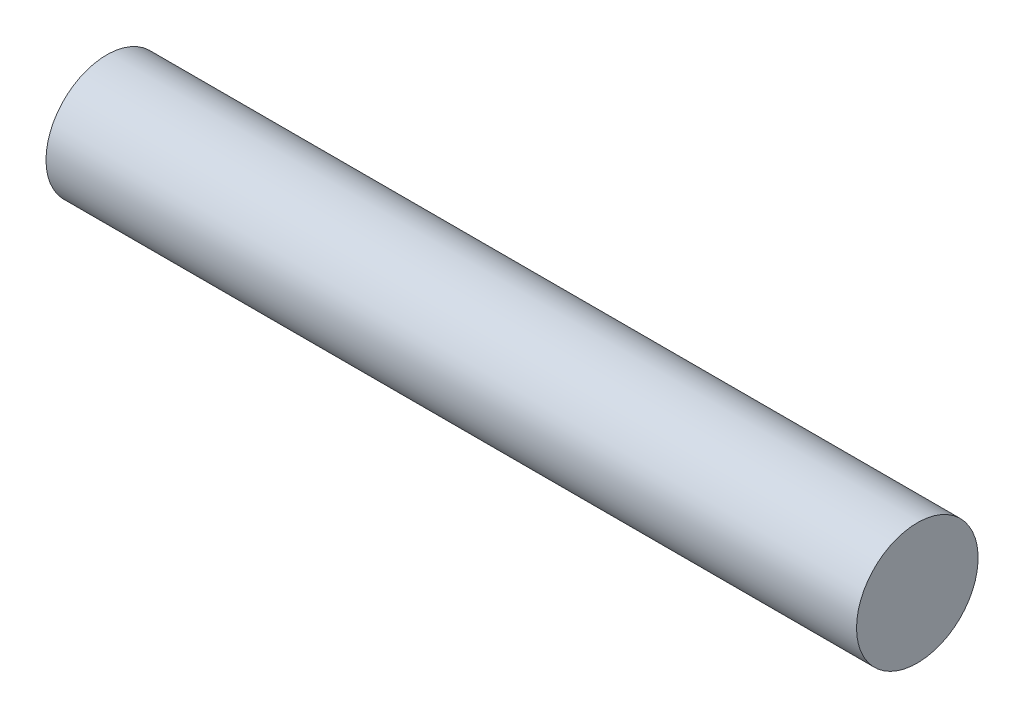
ISO-10303-21;
HEADER;
FILE_DESCRIPTION(('STEP AP214'),'2;1');
FILE_NAME('part.step','',(''),(''),'','','');
FILE_SCHEMA(('AUTOMOTIVE_DESIGN { 1 0 10303 214 1 1 1 1 }'));
ENDSEC;
DATA;
#1=APPLICATION_CONTEXT('core data for automotive mechanical design processes');
#2=APPLICATION_PROTOCOL_DEFINITION('international standard','automotive_design',2000,#1);
#3=PRODUCT_CONTEXT('',#1,'mechanical');
#4=PRODUCT('Part','Part','',(#3));
#5=PRODUCT_RELATED_PRODUCT_CATEGORY('part','',(#4));
#6=PRODUCT_DEFINITION_FORMATION('','',#4);
#7=PRODUCT_DEFINITION_CONTEXT('part definition',#1,'design');
#8=PRODUCT_DEFINITION('design','',#6,#7);
#9=PRODUCT_DEFINITION_SHAPE('','',#8);
#10=(LENGTH_UNIT() NAMED_UNIT(*) SI_UNIT(.MILLI.,.METRE.));
#11=(NAMED_UNIT(*) PLANE_ANGLE_UNIT() SI_UNIT($,.RADIAN.));
#12=(NAMED_UNIT(*) SI_UNIT($,.STERADIAN.) SOLID_ANGLE_UNIT());
#13=UNCERTAINTY_MEASURE_WITH_UNIT(LENGTH_MEASURE(1.E-05),#10,'distance_accuracy_value','');
#14=(GEOMETRIC_REPRESENTATION_CONTEXT(3) GLOBAL_UNCERTAINTY_ASSIGNED_CONTEXT((#13)) GLOBAL_UNIT_ASSIGNED_CONTEXT((#10,
#11,#12)) REPRESENTATION_CONTEXT('',''));
#15=CARTESIAN_POINT('',(0.,0.,0.));
#16=DIRECTION('',(0.,0.,1.));
#17=DIRECTION('',(1.,0.,0.));
#18=AXIS2_PLACEMENT_3D('',#15,#16,#17);
#19=CARTESIAN_POINT('',(-38.1,0.,0.));
#20=DIRECTION('',(-1.,0.,0.));
#21=DIRECTION('',(0.,0.,1.));
#22=AXIS2_PLACEMENT_3D('',#19,#20,#21);
#23=PLANE('',#22);
#24=CARTESIAN_POINT('',(-38.1,0.,17.145));
#25=DIRECTION('',(-1.,0.,0.));
#26=DIRECTION('',(0.,0.,1.));
#27=AXIS2_PLACEMENT_3D('',#24,#25,#26);
#28=CIRCLE('',#27,17.145);
#29=CARTESIAN_POINT('',(-38.1,0.,34.29));
#30=VERTEX_POINT('',#29);
#31=EDGE_CURVE('E10',#30,#30,#28,.T.);
#32=ORIENTED_EDGE('',*,*,#31,.T.);
#33=EDGE_LOOP('',(#32));
#34=FACE_BOUND('',#33,.T.);
#35=ADVANCED_FACE('F32',(#34),#23,.T.);
#36=CARTESIAN_POINT('',(-38.1,0.,17.145));
#37=DIRECTION('',(-1.,0.,0.));
#38=DIRECTION('',(0.,0.,1.));
#39=AXIS2_PLACEMENT_3D('',#36,#37,#38);
#40=CYLINDRICAL_SURFACE('',#39,17.145);
#41=CARTESIAN_POINT('',(190.5,0.,17.145));
#42=DIRECTION('',(-1.,0.,0.));
#43=DIRECTION('',(0.,0.,1.));
#44=AXIS2_PLACEMENT_3D('',#41,#42,#43);
#45=CIRCLE('',#44,17.145);
#46=CARTESIAN_POINT('',(190.5,0.,34.29));
#47=VERTEX_POINT('',#46);
#48=EDGE_CURVE('E38',#47,#47,#45,.T.);
#49=ORIENTED_EDGE('',*,*,#48,.T.);
#50=EDGE_LOOP('',(#49));
#51=FACE_BOUND('',#50,.T.);
#52=ORIENTED_EDGE('',*,*,#31,.F.);
#53=EDGE_LOOP('',(#52));
#54=FACE_BOUND('',#53,.T.);
#55=ADVANCED_FACE('F44',(#51,#54),#40,.T.);
#56=CARTESIAN_POINT('',(190.5,0.,0.));
#57=DIRECTION('',(1.,0.,0.));
#58=DIRECTION('',(0.,0.,-1.));
#59=AXIS2_PLACEMENT_3D('',#56,#57,#58);
#60=PLANE('',#59);
#61=ORIENTED_EDGE('',*,*,#48,.F.);
#62=EDGE_LOOP('',(#61));
#63=FACE_BOUND('',#62,.T.);
#64=ADVANCED_FACE('F47',(#63),#60,.T.);
#65=CLOSED_SHELL('',(#35,#55,#64));
#66=MANIFOLD_SOLID_BREP('B2',#65);
#67=ADVANCED_BREP_SHAPE_REPRESENTATION('',(#18,#66),#14);
#68=SHAPE_DEFINITION_REPRESENTATION(#9,#67);
ENDSEC;
END-ISO-10303-21;
